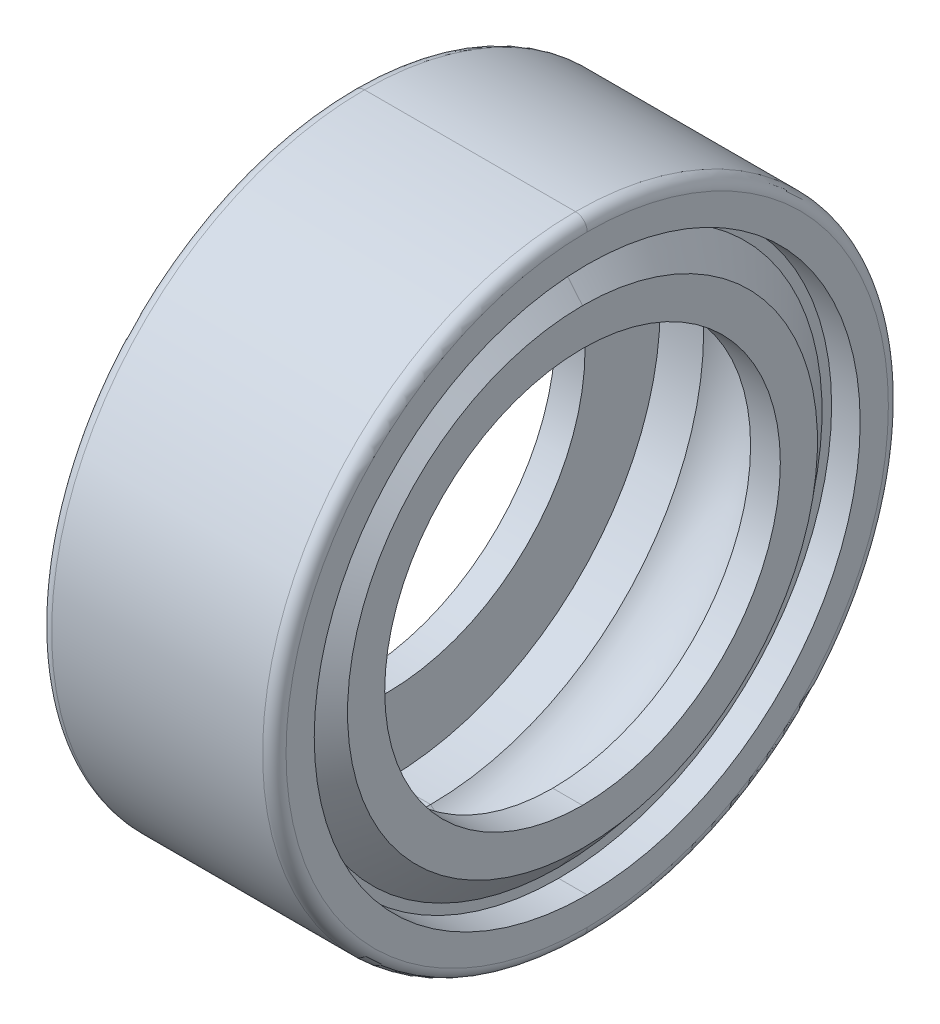
ISO-10303-21;
HEADER;
FILE_DESCRIPTION(('STEP AP214'),'2;1');
FILE_NAME('part.step','',(''),(''),'','','');
FILE_SCHEMA(('AUTOMOTIVE_DESIGN { 1 0 10303 214 1 1 1 1 }'));
ENDSEC;
DATA;
#1=APPLICATION_CONTEXT('core data for automotive mechanical design processes');
#2=APPLICATION_PROTOCOL_DEFINITION('international standard','automotive_design',2000,#1);
#3=PRODUCT_CONTEXT('',#1,'mechanical');
#4=PRODUCT('Part','Part','',(#3));
#5=PRODUCT_RELATED_PRODUCT_CATEGORY('part','',(#4));
#6=PRODUCT_DEFINITION_FORMATION('','',#4);
#7=PRODUCT_DEFINITION_CONTEXT('part definition',#1,'design');
#8=PRODUCT_DEFINITION('design','',#6,#7);
#9=PRODUCT_DEFINITION_SHAPE('','',#8);
#10=(LENGTH_UNIT() NAMED_UNIT(*) SI_UNIT(.MILLI.,.METRE.));
#11=(NAMED_UNIT(*) PLANE_ANGLE_UNIT() SI_UNIT($,.RADIAN.));
#12=(NAMED_UNIT(*) SI_UNIT($,.STERADIAN.) SOLID_ANGLE_UNIT());
#13=UNCERTAINTY_MEASURE_WITH_UNIT(LENGTH_MEASURE(1.E-05),#10,'distance_accuracy_value','');
#14=(GEOMETRIC_REPRESENTATION_CONTEXT(3) GLOBAL_UNCERTAINTY_ASSIGNED_CONTEXT((#13)) GLOBAL_UNIT_ASSIGNED_CONTEXT((#10,
#11,#12)) REPRESENTATION_CONTEXT('',''));
#15=CARTESIAN_POINT('',(0.,0.,0.));
#16=DIRECTION('',(0.,0.,1.));
#17=DIRECTION('',(1.,0.,0.));
#18=AXIS2_PLACEMENT_3D('',#15,#16,#17);
#19=CARTESIAN_POINT('',(-1.1334312014104,0.,0.));
#20=DIRECTION('',(1.,0.,0.));
#21=DIRECTION('',(0.,1.,0.));
#22=AXIS2_PLACEMENT_3D('',#19,#20,#21);
#23=PLANE('',#22);
#24=CARTESIAN_POINT('',(-1.1334312014104,0.,0.));
#25=DIRECTION('',(-1.,0.,0.));
#26=DIRECTION('',(0.,1.,0.));
#27=AXIS2_PLACEMENT_3D('',#24,#25,#26);
#28=CIRCLE('',#27,3.368081021);
#29=CARTESIAN_POINT('',(-1.1334312014104,3.368081021,0.));
#30=VERTEX_POINT('',#29);
#31=CARTESIAN_POINT('',(-1.1334312014104,-3.368081021,0.));
#32=VERTEX_POINT('',#31);
#33=EDGE_CURVE('E280',#30,#32,#28,.T.);
#34=ORIENTED_EDGE('',*,*,#33,.F.);
#35=CARTESIAN_POINT('',(-1.1334312014104,0.,0.));
#36=DIRECTION('',(1.,0.,0.));
#37=DIRECTION('',(0.,1.,0.));
#38=AXIS2_PLACEMENT_3D('',#35,#36,#37);
#39=CIRCLE('',#38,3.368081021);
#40=EDGE_CURVE('E228',#30,#32,#39,.T.);
#41=ORIENTED_EDGE('',*,*,#40,.T.);
#42=EDGE_LOOP('',(#34,#41));
#43=FACE_BOUND('',#42,.T.);
#44=CARTESIAN_POINT('',(-1.1334312014104,0.,0.));
#45=DIRECTION('',(1.,0.,0.));
#46=DIRECTION('',(0.,-1.,0.));
#47=AXIS2_PLACEMENT_3D('',#44,#45,#46);
#48=CIRCLE('',#47,3.4902394);
#49=CARTESIAN_POINT('',(-1.1334312014104,-3.4902394,0.));
#50=VERTEX_POINT('',#49);
#51=CARTESIAN_POINT('',(-1.1334312014104,3.4902394,0.));
#52=VERTEX_POINT('',#51);
#53=EDGE_CURVE('E28',#50,#52,#48,.T.);
#54=ORIENTED_EDGE('',*,*,#53,.F.);
#55=CARTESIAN_POINT('',(-1.1334312014104,0.,0.));
#56=DIRECTION('',(1.,0.,0.));
#57=DIRECTION('',(0.,1.,0.));
#58=AXIS2_PLACEMENT_3D('',#55,#56,#57);
#59=CIRCLE('',#58,3.4902394);
#60=EDGE_CURVE('E11',#52,#50,#59,.T.);
#61=ORIENTED_EDGE('',*,*,#60,.F.);
#62=EDGE_LOOP('',(#54,#61));
#63=FACE_BOUND('',#62,.T.);
#64=ADVANCED_FACE('F17',(#43,#63),#23,.F.);
#65=CARTESIAN_POINT('',(-1.64846,0.,0.));
#66=DIRECTION('',(1.,0.,0.));
#67=DIRECTION('',(0.,-1.,0.));
#68=AXIS2_PLACEMENT_3D('',#65,#66,#67);
#69=CYLINDRICAL_SURFACE('',#68,3.4902394);
#70=DIRECTION('',(1.,0.,0.));
#71=VECTOR('',#70,1.);
#72=CARTESIAN_POINT('',(-1.4986,-3.4902394,0.));
#73=LINE('',#72,#71);
#74=CARTESIAN_POINT('',(-1.4986,-3.4902394,0.));
#75=VERTEX_POINT('',#74);
#76=EDGE_CURVE('E253',#75,#50,#73,.T.);
#77=ORIENTED_EDGE('',*,*,#76,.F.);
#78=CARTESIAN_POINT('',(-1.4986,0.,0.));
#79=DIRECTION('',(1.,0.,0.));
#80=DIRECTION('',(0.,1.,0.));
#81=AXIS2_PLACEMENT_3D('',#78,#79,#80);
#82=CIRCLE('',#81,3.4902394);
#83=CARTESIAN_POINT('',(-1.4986,3.4902394,0.));
#84=VERTEX_POINT('',#83);
#85=EDGE_CURVE('E275',#84,#75,#82,.T.);
#86=ORIENTED_EDGE('',*,*,#85,.F.);
#87=DIRECTION('',(1.,0.,0.));
#88=VECTOR('',#87,1.);
#89=CARTESIAN_POINT('',(-1.4986,3.4902394,0.));
#90=LINE('',#89,#88);
#91=EDGE_CURVE('E272',#84,#52,#90,.T.);
#92=ORIENTED_EDGE('',*,*,#91,.T.);
#93=ORIENTED_EDGE('',*,*,#60,.T.);
#94=EDGE_LOOP('',(#77,#86,#92,#93));
#95=FACE_BOUND('',#94,.T.);
#96=ADVANCED_FACE('F415',(#95),#69,.F.);
#97=CARTESIAN_POINT('',(-1.64846,0.,0.));
#98=DIRECTION('',(1.,0.,0.));
#99=DIRECTION('',(0.,-1.,0.));
#100=AXIS2_PLACEMENT_3D('',#97,#98,#99);
#101=CYLINDRICAL_SURFACE('',#100,3.4902394);
#102=ORIENTED_EDGE('',*,*,#91,.F.);
#103=CARTESIAN_POINT('',(-1.4986,0.,0.));
#104=DIRECTION('',(-1.,0.,0.));
#105=DIRECTION('',(0.,1.,0.));
#106=AXIS2_PLACEMENT_3D('',#103,#104,#105);
#107=CIRCLE('',#106,3.4902394);
#108=EDGE_CURVE('E21',#84,#75,#107,.T.);
#109=ORIENTED_EDGE('',*,*,#108,.T.);
#110=ORIENTED_EDGE('',*,*,#76,.T.);
#111=ORIENTED_EDGE('',*,*,#53,.T.);
#112=EDGE_LOOP('',(#102,#109,#110,#111));
#113=FACE_BOUND('',#112,.T.);
#114=ADVANCED_FACE('F413',(#113),#101,.F.);
#115=CARTESIAN_POINT('',(-1.4986,0.,0.));
#116=DIRECTION('',(1.,0.,0.));
#117=DIRECTION('',(0.,1.,0.));
#118=AXIS2_PLACEMENT_3D('',#115,#116,#117);
#119=PLANE('',#118);
#120=ORIENTED_EDGE('',*,*,#108,.F.);
#121=ORIENTED_EDGE('',*,*,#85,.T.);
#122=EDGE_LOOP('',(#120,#121));
#123=FACE_BOUND('',#122,.T.);
#124=CARTESIAN_POINT('',(-1.4986,0.,0.));
#125=DIRECTION('',(1.,0.,0.));
#126=DIRECTION('',(0.,1.,0.));
#127=AXIS2_PLACEMENT_3D('',#124,#125,#126);
#128=CIRCLE('',#127,3.85064);
#129=CARTESIAN_POINT('',(-1.4986,3.85064,0.));
#130=VERTEX_POINT('',#129);
#131=CARTESIAN_POINT('',(-1.4986,-3.85064,0.));
#132=VERTEX_POINT('',#131);
#133=EDGE_CURVE('E192',#130,#132,#128,.T.);
#134=ORIENTED_EDGE('',*,*,#133,.F.);
#135=CARTESIAN_POINT('',(-1.4986,0.,0.));
#136=DIRECTION('',(-1.,0.,0.));
#137=DIRECTION('',(0.,1.,0.));
#138=AXIS2_PLACEMENT_3D('',#135,#136,#137);
#139=CIRCLE('',#138,3.85064);
#140=EDGE_CURVE('E179',#130,#132,#139,.T.);
#141=ORIENTED_EDGE('',*,*,#140,.T.);
#142=EDGE_LOOP('',(#134,#141));
#143=FACE_BOUND('',#142,.T.);
#144=ADVANCED_FACE('F417',(#123,#143),#119,.F.);
#145=CARTESIAN_POINT('',(-1.34874,0.,0.));
#146=DIRECTION('',(1.,0.,0.));
#147=DIRECTION('',(0.,-1.,0.));
#148=AXIS2_PLACEMENT_3D('',#145,#146,#147);
#149=TOROIDAL_SURFACE('',#148,3.85064,0.14986);
#150=CARTESIAN_POINT('',(-1.34874,0.,0.));
#151=DIRECTION('',(-1.,0.,0.));
#152=DIRECTION('',(0.,1.,0.));
#153=AXIS2_PLACEMENT_3D('',#150,#151,#152);
#154=CIRCLE('',#153,4.0005);
#155=CARTESIAN_POINT('',(-1.34874,4.0005,0.));
#156=VERTEX_POINT('',#155);
#157=CARTESIAN_POINT('',(-1.34874,-4.0005,0.));
#158=VERTEX_POINT('',#157);
#159=EDGE_CURVE('E176',#156,#158,#154,.T.);
#160=ORIENTED_EDGE('',*,*,#159,.T.);
#161=CARTESIAN_POINT('',(-1.34874,-3.85064,0.));
#162=DIRECTION('',(0.,0.,-1.));
#163=DIRECTION('',(0.,-1.,0.));
#164=AXIS2_PLACEMENT_3D('',#161,#162,#163);
#165=CIRCLE('',#164,0.14986);
#166=EDGE_CURVE('E184',#158,#132,#165,.T.);
#167=ORIENTED_EDGE('',*,*,#166,.T.);
#168=ORIENTED_EDGE('',*,*,#140,.F.);
#169=CARTESIAN_POINT('',(-1.34874,3.85064,0.));
#170=DIRECTION('',(0.,0.,1.));
#171=DIRECTION('',(0.,1.,0.));
#172=AXIS2_PLACEMENT_3D('',#169,#170,#171);
#173=CIRCLE('',#172,0.14986);
#174=EDGE_CURVE('E171',#156,#130,#173,.T.);
#175=ORIENTED_EDGE('',*,*,#174,.F.);
#176=EDGE_LOOP('',(#160,#167,#168,#175));
#177=FACE_BOUND('',#176,.T.);
#178=ADVANCED_FACE('F173',(#177),#149,.T.);
#179=CARTESIAN_POINT('',(-1.34874,0.,0.));
#180=DIRECTION('',(1.,0.,0.));
#181=DIRECTION('',(0.,-1.,0.));
#182=AXIS2_PLACEMENT_3D('',#179,#180,#181);
#183=TOROIDAL_SURFACE('',#182,3.85064,0.14986);
#184=ORIENTED_EDGE('',*,*,#133,.T.);
#185=ORIENTED_EDGE('',*,*,#166,.F.);
#186=CARTESIAN_POINT('',(-1.34874,0.,0.));
#187=DIRECTION('',(1.,0.,0.));
#188=DIRECTION('',(0.,1.,0.));
#189=AXIS2_PLACEMENT_3D('',#186,#187,#188);
#190=CIRCLE('',#189,4.0005);
#191=EDGE_CURVE('E187',#156,#158,#190,.T.);
#192=ORIENTED_EDGE('',*,*,#191,.F.);
#193=ORIENTED_EDGE('',*,*,#174,.T.);
#194=EDGE_LOOP('',(#184,#185,#192,#193));
#195=FACE_BOUND('',#194,.T.);
#196=ADVANCED_FACE('F189',(#195),#183,.T.);
#197=CARTESIAN_POINT('',(-1.64846,0.,0.));
#198=DIRECTION('',(1.,0.,0.));
#199=DIRECTION('',(0.,-1.,0.));
#200=AXIS2_PLACEMENT_3D('',#197,#198,#199);
#201=CYLINDRICAL_SURFACE('',#200,4.0005);
#202=ORIENTED_EDGE('',*,*,#191,.T.);
#203=DIRECTION('',(-1.,0.,0.));
#204=VECTOR('',#203,1.);
#205=CARTESIAN_POINT('',(1.34874,-4.0005,0.));
#206=LINE('',#205,#204);
#207=CARTESIAN_POINT('',(1.34874,-4.0005,0.));
#208=VERTEX_POINT('',#207);
#209=EDGE_CURVE('E206',#208,#158,#206,.T.);
#210=ORIENTED_EDGE('',*,*,#209,.F.);
#211=CARTESIAN_POINT('',(1.34874,0.,0.));
#212=DIRECTION('',(1.,0.,0.));
#213=DIRECTION('',(0.,1.,0.));
#214=AXIS2_PLACEMENT_3D('',#211,#212,#213);
#215=CIRCLE('',#214,4.0005);
#216=CARTESIAN_POINT('',(1.34874,4.0005,0.));
#217=VERTEX_POINT('',#216);
#218=EDGE_CURVE('E199',#217,#208,#215,.T.);
#219=ORIENTED_EDGE('',*,*,#218,.F.);
#220=DIRECTION('',(-1.,0.,0.));
#221=VECTOR('',#220,1.);
#222=CARTESIAN_POINT('',(1.34874,4.0005,0.));
#223=LINE('',#222,#221);
#224=EDGE_CURVE('E193',#217,#156,#223,.T.);
#225=ORIENTED_EDGE('',*,*,#224,.T.);
#226=EDGE_LOOP('',(#202,#210,#219,#225));
#227=FACE_BOUND('',#226,.T.);
#228=ADVANCED_FACE('F197',(#227),#201,.T.);
#229=CARTESIAN_POINT('',(-1.64846,0.,0.));
#230=DIRECTION('',(1.,0.,0.));
#231=DIRECTION('',(0.,-1.,0.));
#232=AXIS2_PLACEMENT_3D('',#229,#230,#231);
#233=CYLINDRICAL_SURFACE('',#232,4.0005);
#234=CARTESIAN_POINT('',(1.34874,0.,0.));
#235=DIRECTION('',(-1.,0.,0.));
#236=DIRECTION('',(0.,1.,0.));
#237=AXIS2_PLACEMENT_3D('',#234,#235,#236);
#238=CIRCLE('',#237,4.0005);
#239=EDGE_CURVE('E213',#217,#208,#238,.T.);
#240=ORIENTED_EDGE('',*,*,#239,.T.);
#241=ORIENTED_EDGE('',*,*,#209,.T.);
#242=ORIENTED_EDGE('',*,*,#159,.F.);
#243=ORIENTED_EDGE('',*,*,#224,.F.);
#244=EDGE_LOOP('',(#240,#241,#242,#243));
#245=FACE_BOUND('',#244,.T.);
#246=ADVANCED_FACE('F205',(#245),#233,.T.);
#247=CARTESIAN_POINT('',(1.34874,0.,0.));
#248=DIRECTION('',(1.,0.,0.));
#249=DIRECTION('',(0.,-1.,0.));
#250=AXIS2_PLACEMENT_3D('',#247,#248,#249);
#251=TOROIDAL_SURFACE('',#250,3.85064,0.14986);
#252=CARTESIAN_POINT('',(1.4986,0.,0.));
#253=DIRECTION('',(-1.,0.,0.));
#254=DIRECTION('',(0.,1.,0.));
#255=AXIS2_PLACEMENT_3D('',#252,#253,#254);
#256=CIRCLE('',#255,3.85064);
#257=CARTESIAN_POINT('',(1.4986,3.85064,0.));
#258=VERTEX_POINT('',#257);
#259=CARTESIAN_POINT('',(1.4986,-3.85064,0.));
#260=VERTEX_POINT('',#259);
#261=EDGE_CURVE('E298',#258,#260,#256,.T.);
#262=ORIENTED_EDGE('',*,*,#261,.T.);
#263=CARTESIAN_POINT('',(1.34874,-3.85064,0.));
#264=DIRECTION('',(0.,0.,-1.));
#265=DIRECTION('',(1.,0.,0.));
#266=AXIS2_PLACEMENT_3D('',#263,#264,#265);
#267=CIRCLE('',#266,0.14986);
#268=EDGE_CURVE('E261',#260,#208,#267,.T.);
#269=ORIENTED_EDGE('',*,*,#268,.T.);
#270=ORIENTED_EDGE('',*,*,#239,.F.);
#271=CARTESIAN_POINT('',(1.34874,3.85064,0.));
#272=DIRECTION('',(0.,0.,1.));
#273=DIRECTION('',(1.,0.,0.));
#274=AXIS2_PLACEMENT_3D('',#271,#272,#273);
#275=CIRCLE('',#274,0.14986);
#276=EDGE_CURVE('E257',#258,#217,#275,.T.);
#277=ORIENTED_EDGE('',*,*,#276,.F.);
#278=EDGE_LOOP('',(#262,#269,#270,#277));
#279=FACE_BOUND('',#278,.T.);
#280=ADVANCED_FACE('F384',(#279),#251,.T.);
#281=CARTESIAN_POINT('',(1.34874,0.,0.));
#282=DIRECTION('',(1.,0.,0.));
#283=DIRECTION('',(0.,-1.,0.));
#284=AXIS2_PLACEMENT_3D('',#281,#282,#283);
#285=TOROIDAL_SURFACE('',#284,3.85064,0.14986);
#286=ORIENTED_EDGE('',*,*,#218,.T.);
#287=ORIENTED_EDGE('',*,*,#268,.F.);
#288=CARTESIAN_POINT('',(1.4986,0.,0.));
#289=DIRECTION('',(1.,0.,0.));
#290=DIRECTION('',(0.,1.,0.));
#291=AXIS2_PLACEMENT_3D('',#288,#289,#290);
#292=CIRCLE('',#291,3.85064);
#293=EDGE_CURVE('E302',#258,#260,#292,.T.);
#294=ORIENTED_EDGE('',*,*,#293,.F.);
#295=ORIENTED_EDGE('',*,*,#276,.T.);
#296=EDGE_LOOP('',(#286,#287,#294,#295));
#297=FACE_BOUND('',#296,.T.);
#298=ADVANCED_FACE('F385',(#297),#285,.T.);
#299=CARTESIAN_POINT('',(1.4986,0.,0.));
#300=DIRECTION('',(1.,0.,0.));
#301=DIRECTION('',(0.,1.,0.));
#302=AXIS2_PLACEMENT_3D('',#299,#300,#301);
#303=PLANE('',#302);
#304=CARTESIAN_POINT('',(1.4986,0.,0.));
#305=DIRECTION('',(1.,0.,0.));
#306=DIRECTION('',(0.,1.,0.));
#307=AXIS2_PLACEMENT_3D('',#304,#305,#306);
#308=CIRCLE('',#307,3.4902394);
#309=CARTESIAN_POINT('',(1.4986,3.4902394,0.));
#310=VERTEX_POINT('',#309);
#311=CARTESIAN_POINT('',(1.4986,-3.4902394,0.));
#312=VERTEX_POINT('',#311);
#313=EDGE_CURVE('E314',#310,#312,#308,.T.);
#314=ORIENTED_EDGE('',*,*,#313,.F.);
#315=CARTESIAN_POINT('',(1.4986,0.,0.));
#316=DIRECTION('',(-1.,0.,0.));
#317=DIRECTION('',(0.,1.,0.));
#318=AXIS2_PLACEMENT_3D('',#315,#316,#317);
#319=CIRCLE('',#318,3.4902394);
#320=EDGE_CURVE('E303',#310,#312,#319,.T.);
#321=ORIENTED_EDGE('',*,*,#320,.T.);
#322=EDGE_LOOP('',(#314,#321));
#323=FACE_BOUND('',#322,.T.);
#324=ORIENTED_EDGE('',*,*,#261,.F.);
#325=ORIENTED_EDGE('',*,*,#293,.T.);
#326=EDGE_LOOP('',(#324,#325));
#327=FACE_BOUND('',#326,.T.);
#328=ADVANCED_FACE('F379',(#323,#327),#303,.T.);
#329=CARTESIAN_POINT('',(-1.64846,0.,0.));
#330=DIRECTION('',(1.,0.,0.));
#331=DIRECTION('',(0.,-1.,0.));
#332=AXIS2_PLACEMENT_3D('',#329,#330,#331);
#333=CYLINDRICAL_SURFACE('',#332,3.4902394);
#334=DIRECTION('',(1.,0.,0.));
#335=VECTOR('',#334,1.);
#336=CARTESIAN_POINT('',(1.1334312014104,-3.4902394,0.));
#337=LINE('',#336,#335);
#338=CARTESIAN_POINT('',(1.1334312014104,-3.4902394,0.));
#339=VERTEX_POINT('',#338);
#340=EDGE_CURVE('E294',#339,#312,#337,.T.);
#341=ORIENTED_EDGE('',*,*,#340,.T.);
#342=ORIENTED_EDGE('',*,*,#320,.F.);
#343=DIRECTION('',(1.,0.,0.));
#344=VECTOR('',#343,1.);
#345=CARTESIAN_POINT('',(1.1334312014104,3.4902394,0.));
#346=LINE('',#345,#344);
#347=CARTESIAN_POINT('',(1.1334312014104,3.4902394,0.));
#348=VERTEX_POINT('',#347);
#349=EDGE_CURVE('E363',#348,#310,#346,.T.);
#350=ORIENTED_EDGE('',*,*,#349,.F.);
#351=CARTESIAN_POINT('',(1.1334312014104,0.,0.));
#352=DIRECTION('',(1.,0.,0.));
#353=DIRECTION('',(0.,-1.,0.));
#354=AXIS2_PLACEMENT_3D('',#351,#352,#353);
#355=CIRCLE('',#354,3.4902394);
#356=EDGE_CURVE('E293',#339,#348,#355,.T.);
#357=ORIENTED_EDGE('',*,*,#356,.F.);
#358=EDGE_LOOP('',(#341,#342,#350,#357));
#359=FACE_BOUND('',#358,.T.);
#360=ADVANCED_FACE('F451',(#359),#333,.F.);
#361=CARTESIAN_POINT('',(1.1334312014104,0.,0.));
#362=DIRECTION('',(1.,0.,0.));
#363=DIRECTION('',(0.,1.,0.));
#364=AXIS2_PLACEMENT_3D('',#361,#362,#363);
#365=PLANE('',#364);
#366=CARTESIAN_POINT('',(1.1334312014104,0.,0.));
#367=DIRECTION('',(1.,0.,0.));
#368=DIRECTION('',(0.,1.,0.));
#369=AXIS2_PLACEMENT_3D('',#366,#367,#368);
#370=CIRCLE('',#369,3.368081021);
#371=CARTESIAN_POINT('',(1.1334312014104,3.368081021,0.));
#372=VERTEX_POINT('',#371);
#373=CARTESIAN_POINT('',(1.1334312014104,-3.368081021,0.));
#374=VERTEX_POINT('',#373);
#375=EDGE_CURVE('E218',#372,#374,#370,.T.);
#376=ORIENTED_EDGE('',*,*,#375,.F.);
#377=CARTESIAN_POINT('',(1.1334312014104,0.,0.));
#378=DIRECTION('',(-1.,0.,0.));
#379=DIRECTION('',(0.,1.,0.));
#380=AXIS2_PLACEMENT_3D('',#377,#378,#379);
#381=CIRCLE('',#380,3.368081021);
#382=EDGE_CURVE('E367',#372,#374,#381,.T.);
#383=ORIENTED_EDGE('',*,*,#382,.T.);
#384=EDGE_LOOP('',(#376,#383));
#385=FACE_BOUND('',#384,.T.);
#386=ORIENTED_EDGE('',*,*,#356,.T.);
#387=CARTESIAN_POINT('',(1.1334312014104,0.,0.));
#388=DIRECTION('',(1.,0.,0.));
#389=DIRECTION('',(0.,1.,0.));
#390=AXIS2_PLACEMENT_3D('',#387,#388,#389);
#391=CIRCLE('',#390,3.4902394);
#392=EDGE_CURVE('E289',#348,#339,#391,.T.);
#393=ORIENTED_EDGE('',*,*,#392,.T.);
#394=EDGE_LOOP('',(#386,#393));
#395=FACE_BOUND('',#394,.T.);
#396=ADVANCED_FACE('F448',(#385,#395),#365,.T.);
#397=CARTESIAN_POINT('',(-1.64846,0.,0.));
#398=DIRECTION('',(1.,0.,0.));
#399=DIRECTION('',(0.,-1.,0.));
#400=AXIS2_PLACEMENT_3D('',#397,#398,#399);
#401=CYLINDRICAL_SURFACE('',#400,3.4902394);
#402=ORIENTED_EDGE('',*,*,#349,.T.);
#403=ORIENTED_EDGE('',*,*,#313,.T.);
#404=ORIENTED_EDGE('',*,*,#340,.F.);
#405=ORIENTED_EDGE('',*,*,#392,.F.);
#406=EDGE_LOOP('',(#402,#403,#404,#405));
#407=FACE_BOUND('',#406,.T.);
#408=ADVANCED_FACE('F450',(#407),#401,.F.);
#409=CARTESIAN_POINT('',(1.44768486444708,0.,0.));
#410=DIRECTION('',(-1.,0.,0.));
#411=DIRECTION('',(0.,1.,0.));
#412=AXIS2_PLACEMENT_3D('',#409,#410,#411);
#413=CONICAL_SURFACE('',#412,2.99356808909014,0.872664625997164);
#414=CARTESIAN_POINT('',(1.438656,0.,0.));
#415=DIRECTION('',(-1.,0.,0.));
#416=DIRECTION('',(0.,1.,0.));
#417=AXIS2_PLACEMENT_3D('',#414,#415,#416);
#418=CIRCLE('',#417,3.004328270732);
#419=CARTESIAN_POINT('',(1.438656,3.004328270732,0.));
#420=VERTEX_POINT('',#419);
#421=CARTESIAN_POINT('',(1.438656,-3.004328270732,0.));
#422=VERTEX_POINT('',#421);
#423=EDGE_CURVE('E345',#420,#422,#418,.T.);
#424=ORIENTED_EDGE('',*,*,#423,.T.);
#425=DIRECTION('',(-0.642787609686539,-0.766044443118978,0.));
#426=VECTOR('',#425,1.);
#427=CARTESIAN_POINT('',(1.438656,-3.004328270732,0.));
#428=LINE('',#427,#426);
#429=EDGE_CURVE('E221',#422,#374,#428,.T.);
#430=ORIENTED_EDGE('',*,*,#429,.T.);
#431=ORIENTED_EDGE('',*,*,#382,.F.);
#432=DIRECTION('',(-0.642787609686539,0.766044443118978,0.));
#433=VECTOR('',#432,1.);
#434=CARTESIAN_POINT('',(1.438656,3.004328270732,0.));
#435=LINE('',#434,#433);
#436=EDGE_CURVE('E349',#420,#372,#435,.T.);
#437=ORIENTED_EDGE('',*,*,#436,.F.);
#438=EDGE_LOOP('',(#424,#430,#431,#437));
#439=FACE_BOUND('',#438,.T.);
#440=ADVANCED_FACE('F498',(#439),#413,.T.);
#441=CARTESIAN_POINT('',(1.44768486444708,0.,0.));
#442=DIRECTION('',(-1.,0.,0.));
#443=DIRECTION('',(0.,1.,0.));
#444=AXIS2_PLACEMENT_3D('',#441,#442,#443);
#445=CONICAL_SURFACE('',#444,2.99356808909014,0.872664625997164);
#446=ORIENTED_EDGE('',*,*,#375,.T.);
#447=ORIENTED_EDGE('',*,*,#429,.F.);
#448=CARTESIAN_POINT('',(1.438656,0.,0.));
#449=DIRECTION('',(1.,0.,0.));
#450=DIRECTION('',(0.,1.,0.));
#451=AXIS2_PLACEMENT_3D('',#448,#449,#450);
#452=CIRCLE('',#451,3.004328270732);
#453=EDGE_CURVE('E222',#420,#422,#452,.T.);
#454=ORIENTED_EDGE('',*,*,#453,.F.);
#455=ORIENTED_EDGE('',*,*,#436,.T.);
#456=EDGE_LOOP('',(#446,#447,#454,#455));
#457=FACE_BOUND('',#456,.T.);
#458=ADVANCED_FACE('F494',(#457),#445,.T.);
#459=CARTESIAN_POINT('',(1.438656,0.,0.));
#460=DIRECTION('',(1.,0.,0.));
#461=DIRECTION('',(0.,1.,0.));
#462=AXIS2_PLACEMENT_3D('',#459,#460,#461);
#463=PLANE('',#462);
#464=CARTESIAN_POINT('',(1.438656,0.,0.));
#465=DIRECTION('',(1.,0.,0.));
#466=DIRECTION('',(0.,1.,0.));
#467=AXIS2_PLACEMENT_3D('',#464,#465,#466);
#468=CIRCLE('',#467,2.529202206);
#469=CARTESIAN_POINT('',(1.438656,2.529202206,0.));
#470=VERTEX_POINT('',#469);
#471=CARTESIAN_POINT('',(1.438656,-2.529202206,0.));
#472=VERTEX_POINT('',#471);
#473=EDGE_CURVE('E271',#470,#472,#468,.T.);
#474=ORIENTED_EDGE('',*,*,#473,.F.);
#475=CARTESIAN_POINT('',(1.438656,0.,0.));
#476=DIRECTION('',(-1.,0.,0.));
#477=DIRECTION('',(0.,1.,0.));
#478=AXIS2_PLACEMENT_3D('',#475,#476,#477);
#479=CIRCLE('',#478,2.529202206);
#480=EDGE_CURVE('E342',#470,#472,#479,.T.);
#481=ORIENTED_EDGE('',*,*,#480,.T.);
#482=EDGE_LOOP('',(#474,#481));
#483=FACE_BOUND('',#482,.T.);
#484=ORIENTED_EDGE('',*,*,#423,.F.);
#485=ORIENTED_EDGE('',*,*,#453,.T.);
#486=EDGE_LOOP('',(#484,#485));
#487=FACE_BOUND('',#486,.T.);
#488=ADVANCED_FACE('F490',(#483,#487),#463,.T.);
#489=CARTESIAN_POINT('',(-1.5825216,0.,0.));
#490=DIRECTION('',(1.,0.,0.));
#491=DIRECTION('',(0.,-1.,0.));
#492=AXIS2_PLACEMENT_3D('',#489,#490,#491);
#493=CYLINDRICAL_SURFACE('',#492,2.529202206);
#494=CARTESIAN_POINT('',(1.0585012014104,0.,0.));
#495=DIRECTION('',(-1.,0.,0.));
#496=DIRECTION('',(0.,1.,0.));
#497=AXIS2_PLACEMENT_3D('',#494,#495,#496);
#498=CIRCLE('',#497,2.529202206);
#499=CARTESIAN_POINT('',(1.0585012014104,2.529202206,0.));
#500=VERTEX_POINT('',#499);
#501=CARTESIAN_POINT('',(1.0585012014104,-2.529202206,0.));
#502=VERTEX_POINT('',#501);
#503=EDGE_CURVE('E232',#500,#502,#498,.T.);
#504=ORIENTED_EDGE('',*,*,#503,.T.);
#505=DIRECTION('',(1.,0.,0.));
#506=VECTOR('',#505,1.);
#507=CARTESIAN_POINT('',(1.0585012014104,-2.529202206,0.));
#508=LINE('',#507,#506);
#509=EDGE_CURVE('E322',#502,#472,#508,.T.);
#510=ORIENTED_EDGE('',*,*,#509,.T.);
#511=ORIENTED_EDGE('',*,*,#480,.F.);
#512=DIRECTION('',(1.,0.,0.));
#513=VECTOR('',#512,1.);
#514=CARTESIAN_POINT('',(1.0585012014104,2.529202206,0.));
#515=LINE('',#514,#513);
#516=EDGE_CURVE('E326',#500,#470,#515,.T.);
#517=ORIENTED_EDGE('',*,*,#516,.F.);
#518=EDGE_LOOP('',(#504,#510,#511,#517));
#519=FACE_BOUND('',#518,.T.);
#520=ADVANCED_FACE('F493',(#519),#493,.F.);
#521=CARTESIAN_POINT('',(-1.5825216,0.,0.));
#522=DIRECTION('',(1.,0.,0.));
#523=DIRECTION('',(0.,-1.,0.));
#524=AXIS2_PLACEMENT_3D('',#521,#522,#523);
#525=CYLINDRICAL_SURFACE('',#524,2.529202206);
#526=ORIENTED_EDGE('',*,*,#473,.T.);
#527=ORIENTED_EDGE('',*,*,#509,.F.);
#528=CARTESIAN_POINT('',(1.0585012014104,0.,0.));
#529=DIRECTION('',(1.,0.,0.));
#530=DIRECTION('',(0.,1.,0.));
#531=AXIS2_PLACEMENT_3D('',#528,#529,#530);
#532=CIRCLE('',#531,2.529202206);
#533=EDGE_CURVE('E236',#500,#502,#532,.T.);
#534=ORIENTED_EDGE('',*,*,#533,.F.);
#535=ORIENTED_EDGE('',*,*,#516,.T.);
#536=EDGE_LOOP('',(#526,#527,#534,#535));
#537=FACE_BOUND('',#536,.T.);
#538=ADVANCED_FACE('F522',(#537),#525,.F.);
#539=CARTESIAN_POINT('',(1.0585012014104,0.,0.));
#540=DIRECTION('',(1.,0.,0.));
#541=DIRECTION('',(0.,1.,0.));
#542=AXIS2_PLACEMENT_3D('',#539,#540,#541);
#543=PLANE('',#542);
#544=ORIENTED_EDGE('',*,*,#503,.F.);
#545=ORIENTED_EDGE('',*,*,#533,.T.);
#546=EDGE_LOOP('',(#544,#545));
#547=FACE_BOUND('',#546,.T.);
#548=CARTESIAN_POINT('',(1.0585012014104,0.,0.));
#549=DIRECTION('',(1.,0.,0.));
#550=DIRECTION('',(0.,-1.,0.));
#551=AXIS2_PLACEMENT_3D('',#548,#549,#550);
#552=CIRCLE('',#551,3.4902394);
#553=CARTESIAN_POINT('',(1.0585012014104,-3.4902394,0.));
#554=VERTEX_POINT('',#553);
#555=CARTESIAN_POINT('',(1.0585012014104,3.4902394,0.));
#556=VERTEX_POINT('',#555);
#557=EDGE_CURVE('E248',#554,#556,#552,.T.);
#558=ORIENTED_EDGE('',*,*,#557,.F.);
#559=CARTESIAN_POINT('',(1.0585012014104,0.,0.));
#560=DIRECTION('',(1.,0.,0.));
#561=DIRECTION('',(0.,1.,0.));
#562=AXIS2_PLACEMENT_3D('',#559,#560,#561);
#563=CIRCLE('',#562,3.4902394);
#564=EDGE_CURVE('E237',#556,#554,#563,.T.);
#565=ORIENTED_EDGE('',*,*,#564,.F.);
#566=EDGE_LOOP('',(#558,#565));
#567=FACE_BOUND('',#566,.T.);
#568=ADVANCED_FACE('F19',(#547,#567),#543,.F.);
#569=CARTESIAN_POINT('',(-1.64846,0.,0.));
#570=DIRECTION('',(1.,0.,0.));
#571=DIRECTION('',(0.,-1.,0.));
#572=AXIS2_PLACEMENT_3D('',#569,#570,#571);
#573=CYLINDRICAL_SURFACE('',#572,3.4902394);
#574=DIRECTION('',(1.,0.,0.));
#575=VECTOR('',#574,1.);
#576=CARTESIAN_POINT('',(0.503000798221672,-3.4902394,0.));
#577=LINE('',#576,#575);
#578=CARTESIAN_POINT('',(0.503000798221672,-3.4902394,0.));
#579=VERTEX_POINT('',#578);
#580=EDGE_CURVE('E244',#579,#554,#577,.T.);
#581=ORIENTED_EDGE('',*,*,#580,.F.);
#582=CARTESIAN_POINT('',(0.503000798221672,0.,0.));
#583=DIRECTION('',(1.,0.,0.));
#584=DIRECTION('',(0.,1.,0.));
#585=AXIS2_PLACEMENT_3D('',#582,#583,#584);
#586=CIRCLE('',#585,3.4902394);
#587=CARTESIAN_POINT('',(0.503000798221672,3.4902394,0.));
#588=VERTEX_POINT('',#587);
#589=EDGE_CURVE('E287',#588,#579,#586,.T.);
#590=ORIENTED_EDGE('',*,*,#589,.F.);
#591=DIRECTION('',(1.,0.,0.));
#592=VECTOR('',#591,1.);
#593=CARTESIAN_POINT('',(0.503000798221672,3.4902394,0.));
#594=LINE('',#593,#592);
#595=EDGE_CURVE('E249',#588,#556,#594,.T.);
#596=ORIENTED_EDGE('',*,*,#595,.T.);
#597=ORIENTED_EDGE('',*,*,#564,.T.);
#598=EDGE_LOOP('',(#581,#590,#596,#597));
#599=FACE_BOUND('',#598,.T.);
#600=ADVANCED_FACE('F470',(#599),#573,.F.);
#601=CARTESIAN_POINT('',(-1.64846,0.,0.));
#602=DIRECTION('',(1.,0.,0.));
#603=DIRECTION('',(0.,-1.,0.));
#604=AXIS2_PLACEMENT_3D('',#601,#602,#603);
#605=CYLINDRICAL_SURFACE('',#604,3.4902394);
#606=ORIENTED_EDGE('',*,*,#595,.F.);
#607=CARTESIAN_POINT('',(0.503000798221672,0.,0.));
#608=DIRECTION('',(-1.,0.,0.));
#609=DIRECTION('',(0.,1.,0.));
#610=AXIS2_PLACEMENT_3D('',#607,#608,#609);
#611=CIRCLE('',#610,3.4902394);
#612=EDGE_CURVE('E304',#588,#579,#611,.T.);
#613=ORIENTED_EDGE('',*,*,#612,.T.);
#614=ORIENTED_EDGE('',*,*,#580,.T.);
#615=ORIENTED_EDGE('',*,*,#557,.T.);
#616=EDGE_LOOP('',(#606,#613,#614,#615));
#617=FACE_BOUND('',#616,.T.);
#618=ADVANCED_FACE('F466',(#617),#605,.F.);
#619=CARTESIAN_POINT('',(0.,0.,0.));
#620=DIRECTION('',(1.,0.,0.));
#621=DIRECTION('',(0.,-1.,0.));
#622=AXIS2_PLACEMENT_3D('',#619,#620,#621);
#623=TOROIDAL_SURFACE('',#622,2.9972,0.704342);
#624=CARTESIAN_POINT('',(-0.503000798221672,0.,0.));
#625=DIRECTION('',(-1.,0.,0.));
#626=DIRECTION('',(0.,1.,0.));
#627=AXIS2_PLACEMENT_3D('',#624,#625,#626);
#628=CIRCLE('',#627,3.4902394);
#629=CARTESIAN_POINT('',(-0.503000798221672,3.4902394,0.));
#630=VERTEX_POINT('',#629);
#631=CARTESIAN_POINT('',(-0.503000798221672,-3.4902394,0.));
#632=VERTEX_POINT('',#631);
#633=EDGE_CURVE('E266',#630,#632,#628,.T.);
#634=ORIENTED_EDGE('',*,*,#633,.T.);
#635=CARTESIAN_POINT('',(0.,-2.9972,0.));
#636=DIRECTION('',(0.,0.,1.));
#637=DIRECTION('',(-0.714142842854284,-0.7,0.));
#638=AXIS2_PLACEMENT_3D('',#635,#636,#637);
#639=CIRCLE('',#638,0.704342);
#640=EDGE_CURVE('E318',#632,#579,#639,.T.);
#641=ORIENTED_EDGE('',*,*,#640,.T.);
#642=ORIENTED_EDGE('',*,*,#612,.F.);
#643=CARTESIAN_POINT('',(0.,2.9972,0.));
#644=DIRECTION('',(0.,0.,-1.));
#645=DIRECTION('',(-0.714142842854284,0.7,0.));
#646=AXIS2_PLACEMENT_3D('',#643,#644,#645);
#647=CIRCLE('',#646,0.704342);
#648=EDGE_CURVE('E308',#630,#588,#647,.T.);
#649=ORIENTED_EDGE('',*,*,#648,.F.);
#650=EDGE_LOOP('',(#634,#641,#642,#649));
#651=FACE_BOUND('',#650,.T.);
#652=ADVANCED_FACE('F469',(#651),#623,.F.);
#653=CARTESIAN_POINT('',(0.,0.,0.));
#654=DIRECTION('',(1.,0.,0.));
#655=DIRECTION('',(0.,-1.,0.));
#656=AXIS2_PLACEMENT_3D('',#653,#654,#655);
#657=TOROIDAL_SURFACE('',#656,2.9972,0.704342);
#658=ORIENTED_EDGE('',*,*,#589,.T.);
#659=ORIENTED_EDGE('',*,*,#640,.F.);
#660=CARTESIAN_POINT('',(-0.503000798221672,0.,0.));
#661=DIRECTION('',(1.,0.,0.));
#662=DIRECTION('',(0.,1.,0.));
#663=AXIS2_PLACEMENT_3D('',#660,#661,#662);
#664=CIRCLE('',#663,3.4902394);
#665=EDGE_CURVE('E283',#630,#632,#664,.T.);
#666=ORIENTED_EDGE('',*,*,#665,.F.);
#667=ORIENTED_EDGE('',*,*,#648,.T.);
#668=EDGE_LOOP('',(#658,#659,#666,#667));
#669=FACE_BOUND('',#668,.T.);
#670=ADVANCED_FACE('F480',(#669),#657,.F.);
#671=CARTESIAN_POINT('',(-1.64846,0.,0.));
#672=DIRECTION('',(1.,0.,0.));
#673=DIRECTION('',(0.,-1.,0.));
#674=AXIS2_PLACEMENT_3D('',#671,#672,#673);
#675=CYLINDRICAL_SURFACE('',#674,3.4902394);
#676=DIRECTION('',(1.,0.,0.));
#677=VECTOR('',#676,1.);
#678=CARTESIAN_POINT('',(-1.0585012014104,3.4902394,0.));
#679=LINE('',#678,#677);
#680=CARTESIAN_POINT('',(-1.0585012014104,3.4902394,0.));
#681=VERTEX_POINT('',#680);
#682=EDGE_CURVE('E359',#681,#630,#679,.T.);
#683=ORIENTED_EDGE('',*,*,#682,.T.);
#684=ORIENTED_EDGE('',*,*,#665,.T.);
#685=DIRECTION('',(1.,0.,0.));
#686=VECTOR('',#685,1.);
#687=CARTESIAN_POINT('',(-1.0585012014104,-3.4902394,0.));
#688=LINE('',#687,#686);
#689=CARTESIAN_POINT('',(-1.0585012014104,-3.4902394,0.));
#690=VERTEX_POINT('',#689);
#691=EDGE_CURVE('E262',#690,#632,#688,.T.);
#692=ORIENTED_EDGE('',*,*,#691,.F.);
#693=CARTESIAN_POINT('',(-1.0585012014104,0.,0.));
#694=DIRECTION('',(1.,0.,0.));
#695=DIRECTION('',(0.,1.,0.));
#696=AXIS2_PLACEMENT_3D('',#693,#694,#695);
#697=CIRCLE('',#696,3.4902394);
#698=EDGE_CURVE('E288',#681,#690,#697,.T.);
#699=ORIENTED_EDGE('',*,*,#698,.F.);
#700=EDGE_LOOP('',(#683,#684,#692,#699));
#701=FACE_BOUND('',#700,.T.);
#702=ADVANCED_FACE('F476',(#701),#675,.F.);
#703=CARTESIAN_POINT('',(-1.0585012014104,0.,0.));
#704=DIRECTION('',(1.,0.,0.));
#705=DIRECTION('',(0.,1.,0.));
#706=AXIS2_PLACEMENT_3D('',#703,#704,#705);
#707=PLANE('',#706);
#708=CARTESIAN_POINT('',(-1.0585012014104,0.,0.));
#709=DIRECTION('',(1.,0.,0.));
#710=DIRECTION('',(0.,1.,0.));
#711=AXIS2_PLACEMENT_3D('',#708,#709,#710);
#712=CIRCLE('',#711,2.529202206);
#713=CARTESIAN_POINT('',(-1.0585012014104,2.529202206,0.));
#714=VERTEX_POINT('',#713);
#715=CARTESIAN_POINT('',(-1.0585012014104,-2.529202206,0.));
#716=VERTEX_POINT('',#715);
#717=EDGE_CURVE('E238',#714,#716,#712,.T.);
#718=ORIENTED_EDGE('',*,*,#717,.F.);
#719=CARTESIAN_POINT('',(-1.0585012014104,0.,0.));
#720=DIRECTION('',(-1.,0.,0.));
#721=DIRECTION('',(0.,1.,0.));
#722=AXIS2_PLACEMENT_3D('',#719,#720,#721);
#723=CIRCLE('',#722,2.529202206);
#724=EDGE_CURVE('E267',#714,#716,#723,.T.);
#725=ORIENTED_EDGE('',*,*,#724,.T.);
#726=EDGE_LOOP('',(#718,#725));
#727=FACE_BOUND('',#726,.T.);
#728=CARTESIAN_POINT('',(-1.0585012014104,0.,0.));
#729=DIRECTION('',(1.,0.,0.));
#730=DIRECTION('',(0.,-1.,0.));
#731=AXIS2_PLACEMENT_3D('',#728,#729,#730);
#732=CIRCLE('',#731,3.4902394);
#733=EDGE_CURVE('E358',#690,#681,#732,.T.);
#734=ORIENTED_EDGE('',*,*,#733,.T.);
#735=ORIENTED_EDGE('',*,*,#698,.T.);
#736=EDGE_LOOP('',(#734,#735));
#737=FACE_BOUND('',#736,.T.);
#738=ADVANCED_FACE('F472',(#727,#737),#707,.T.);
#739=CARTESIAN_POINT('',(-1.64846,0.,0.));
#740=DIRECTION('',(1.,0.,0.));
#741=DIRECTION('',(0.,-1.,0.));
#742=AXIS2_PLACEMENT_3D('',#739,#740,#741);
#743=CYLINDRICAL_SURFACE('',#742,3.4902394);
#744=ORIENTED_EDGE('',*,*,#691,.T.);
#745=ORIENTED_EDGE('',*,*,#633,.F.);
#746=ORIENTED_EDGE('',*,*,#682,.F.);
#747=ORIENTED_EDGE('',*,*,#733,.F.);
#748=EDGE_LOOP('',(#744,#745,#746,#747));
#749=FACE_BOUND('',#748,.T.);
#750=ADVANCED_FACE('F475',(#749),#743,.F.);
#751=CARTESIAN_POINT('',(-1.5825216,0.,0.));
#752=DIRECTION('',(1.,0.,0.));
#753=DIRECTION('',(0.,-1.,0.));
#754=AXIS2_PLACEMENT_3D('',#751,#752,#753);
#755=CYLINDRICAL_SURFACE('',#754,2.529202206);
#756=CARTESIAN_POINT('',(-1.438656,0.,0.));
#757=DIRECTION('',(-1.,0.,0.));
#758=DIRECTION('',(0.,1.,0.));
#759=AXIS2_PLACEMENT_3D('',#756,#757,#758);
#760=CIRCLE('',#759,2.529202206);
#761=CARTESIAN_POINT('',(-1.438656,2.529202206,0.));
#762=VERTEX_POINT('',#761);
#763=CARTESIAN_POINT('',(-1.438656,-2.529202206,0.));
#764=VERTEX_POINT('',#763);
#765=EDGE_CURVE('E332',#762,#764,#760,.T.);
#766=ORIENTED_EDGE('',*,*,#765,.T.);
#767=DIRECTION('',(1.,0.,0.));
#768=VECTOR('',#767,1.);
#769=CARTESIAN_POINT('',(-1.438656,-2.529202206,0.));
#770=LINE('',#769,#768);
#771=EDGE_CURVE('E242',#764,#716,#770,.T.);
#772=ORIENTED_EDGE('',*,*,#771,.T.);
#773=ORIENTED_EDGE('',*,*,#724,.F.);
#774=DIRECTION('',(1.,0.,0.));
#775=VECTOR('',#774,1.);
#776=CARTESIAN_POINT('',(-1.438656,2.529202206,0.));
#777=LINE('',#776,#775);
#778=EDGE_CURVE('E297',#762,#714,#777,.T.);
#779=ORIENTED_EDGE('',*,*,#778,.F.);
#780=EDGE_LOOP('',(#766,#772,#773,#779));
#781=FACE_BOUND('',#780,.T.);
#782=ADVANCED_FACE('F505',(#781),#755,.F.);
#783=CARTESIAN_POINT('',(-1.5825216,0.,0.));
#784=DIRECTION('',(1.,0.,0.));
#785=DIRECTION('',(0.,-1.,0.));
#786=AXIS2_PLACEMENT_3D('',#783,#784,#785);
#787=CYLINDRICAL_SURFACE('',#786,2.529202206);
#788=ORIENTED_EDGE('',*,*,#717,.T.);
#789=ORIENTED_EDGE('',*,*,#771,.F.);
#790=CARTESIAN_POINT('',(-1.438656,0.,0.));
#791=DIRECTION('',(1.,0.,0.));
#792=DIRECTION('',(0.,1.,0.));
#793=AXIS2_PLACEMENT_3D('',#790,#791,#792);
#794=CIRCLE('',#793,2.529202206);
#795=EDGE_CURVE('E243',#762,#764,#794,.T.);
#796=ORIENTED_EDGE('',*,*,#795,.F.);
#797=ORIENTED_EDGE('',*,*,#778,.T.);
#798=EDGE_LOOP('',(#788,#789,#796,#797));
#799=FACE_BOUND('',#798,.T.);
#800=ADVANCED_FACE('F463',(#799),#787,.F.);
#801=CARTESIAN_POINT('',(-1.438656,0.,0.));
#802=DIRECTION('',(1.,0.,0.));
#803=DIRECTION('',(0.,1.,0.));
#804=AXIS2_PLACEMENT_3D('',#801,#802,#803);
#805=PLANE('',#804);
#806=ORIENTED_EDGE('',*,*,#765,.F.);
#807=ORIENTED_EDGE('',*,*,#795,.T.);
#808=EDGE_LOOP('',(#806,#807));
#809=FACE_BOUND('',#808,.T.);
#810=CARTESIAN_POINT('',(-1.438656,0.,0.));
#811=DIRECTION('',(1.,0.,0.));
#812=DIRECTION('',(0.,1.,0.));
#813=AXIS2_PLACEMENT_3D('',#810,#811,#812);
#814=CIRCLE('',#813,3.004328270732);
#815=CARTESIAN_POINT('',(-1.438656,3.004328270732,0.));
#816=VERTEX_POINT('',#815);
#817=CARTESIAN_POINT('',(-1.438656,-3.004328270732,0.));
#818=VERTEX_POINT('',#817);
#819=EDGE_CURVE('E229',#816,#818,#814,.T.);
#820=ORIENTED_EDGE('',*,*,#819,.F.);
#821=CARTESIAN_POINT('',(-1.438656,0.,0.));
#822=DIRECTION('',(-1.,0.,0.));
#823=DIRECTION('',(0.,1.,0.));
#824=AXIS2_PLACEMENT_3D('',#821,#822,#823);
#825=CIRCLE('',#824,3.004328270732);
#826=EDGE_CURVE('E336',#816,#818,#825,.T.);
#827=ORIENTED_EDGE('',*,*,#826,.T.);
#828=EDGE_LOOP('',(#820,#827));
#829=FACE_BOUND('',#828,.T.);
#830=ADVANCED_FACE('F460',(#809,#829),#805,.F.);
#831=CARTESIAN_POINT('',(-1.44768486444708,0.,0.));
#832=DIRECTION('',(1.,0.,0.));
#833=DIRECTION('',(0.,-1.,0.));
#834=AXIS2_PLACEMENT_3D('',#831,#832,#833);
#835=CONICAL_SURFACE('',#834,2.99356808909014,0.872664625997164);
#836=ORIENTED_EDGE('',*,*,#33,.T.);
#837=DIRECTION('',(-0.642787609686539,0.766044443118978,0.));
#838=VECTOR('',#837,1.);
#839=CARTESIAN_POINT('',(-1.1334312014104,-3.368081021,0.));
#840=LINE('',#839,#838);
#841=EDGE_CURVE('E224',#32,#818,#840,.T.);
#842=ORIENTED_EDGE('',*,*,#841,.T.);
#843=ORIENTED_EDGE('',*,*,#826,.F.);
#844=DIRECTION('',(-0.642787609686539,-0.766044443118978,0.));
#845=VECTOR('',#844,1.);
#846=CARTESIAN_POINT('',(-1.1334312014104,3.368081021,0.));
#847=LINE('',#846,#845);
#848=EDGE_CURVE('E276',#30,#816,#847,.T.);
#849=ORIENTED_EDGE('',*,*,#848,.F.);
#850=EDGE_LOOP('',(#836,#842,#843,#849));
#851=FACE_BOUND('',#850,.T.);
#852=ADVANCED_FACE('F456',(#851),#835,.T.);
#853=CARTESIAN_POINT('',(-1.44768486444708,0.,0.));
#854=DIRECTION('',(1.,0.,0.));
#855=DIRECTION('',(0.,-1.,0.));
#856=AXIS2_PLACEMENT_3D('',#853,#854,#855);
#857=CONICAL_SURFACE('',#856,2.99356808909014,0.872664625997164);
#858=ORIENTED_EDGE('',*,*,#819,.T.);
#859=ORIENTED_EDGE('',*,*,#841,.F.);
#860=ORIENTED_EDGE('',*,*,#40,.F.);
#861=ORIENTED_EDGE('',*,*,#848,.T.);
#862=EDGE_LOOP('',(#858,#859,#860,#861));
#863=FACE_BOUND('',#862,.T.);
#864=ADVANCED_FACE('F459',(#863),#857,.T.);
#865=CLOSED_SHELL('',(#64,#96,#114,#144,#178,#196,#228,#246,#280,#298,#328,#360,#396,#408,#440,
#458,#488,#520,#538,#568,#600,#618,#652,#670,#702,#738,#750,#782,#800,#830,#852,#864));
#866=MANIFOLD_SOLID_BREP('B1',#865);
#867=ADVANCED_BREP_SHAPE_REPRESENTATION('',(#18,#866),#14);
#868=SHAPE_DEFINITION_REPRESENTATION(#9,#867);
ENDSEC;
END-ISO-10303-21;
